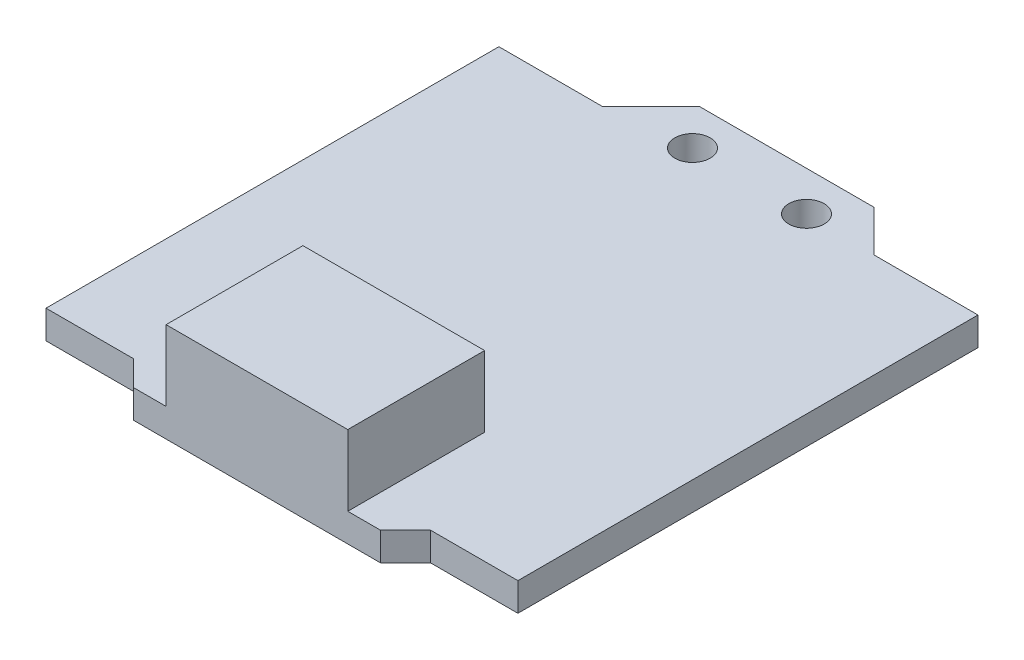
ISO-10303-21;
HEADER;
FILE_DESCRIPTION(('STEP AP214'),'2;1');
FILE_NAME('part.step','',(''),(''),'','','');
FILE_SCHEMA(('AUTOMOTIVE_DESIGN { 1 0 10303 214 1 1 1 1 }'));
ENDSEC;
DATA;
#1=APPLICATION_CONTEXT('core data for automotive mechanical design processes');
#2=APPLICATION_PROTOCOL_DEFINITION('international standard','automotive_design',2000,#1);
#3=PRODUCT_CONTEXT('',#1,'mechanical');
#4=PRODUCT('Part','Part','',(#3));
#5=PRODUCT_RELATED_PRODUCT_CATEGORY('part','',(#4));
#6=PRODUCT_DEFINITION_FORMATION('','',#4);
#7=PRODUCT_DEFINITION_CONTEXT('part definition',#1,'design');
#8=PRODUCT_DEFINITION('design','',#6,#7);
#9=PRODUCT_DEFINITION_SHAPE('','',#8);
#10=(LENGTH_UNIT() NAMED_UNIT(*) SI_UNIT(.MILLI.,.METRE.));
#11=(NAMED_UNIT(*) PLANE_ANGLE_UNIT() SI_UNIT($,.RADIAN.));
#12=(NAMED_UNIT(*) SI_UNIT($,.STERADIAN.) SOLID_ANGLE_UNIT());
#13=UNCERTAINTY_MEASURE_WITH_UNIT(LENGTH_MEASURE(1.E-05),#10,'distance_accuracy_value','');
#14=(GEOMETRIC_REPRESENTATION_CONTEXT(3) GLOBAL_UNCERTAINTY_ASSIGNED_CONTEXT((#13)) GLOBAL_UNIT_ASSIGNED_CONTEXT((#10,
#11,#12)) REPRESENTATION_CONTEXT('',''));
#15=CARTESIAN_POINT('',(0.,0.,0.));
#16=DIRECTION('',(0.,0.,1.));
#17=DIRECTION('',(1.,0.,0.));
#18=AXIS2_PLACEMENT_3D('',#15,#16,#17);
#19=CARTESIAN_POINT('',(0.,1.2,0.));
#20=DIRECTION('',(0.,-1.,0.));
#21=DIRECTION('',(0.,0.,-1.));
#22=AXIS2_PLACEMENT_3D('',#19,#20,#21);
#23=PLANE('',#22);
#24=CARTESIAN_POINT('',(-5.20965393586736,1.2,-12.920685244247));
#25=DIRECTION('',(0.,1.,0.));
#26=DIRECTION('',(0.,0.,1.));
#27=AXIS2_PLACEMENT_3D('',#24,#25,#26);
#28=CIRCLE('',#27,0.75);
#29=CARTESIAN_POINT('',(-5.20965393586736,1.2,-12.170685244247));
#30=VERTEX_POINT('',#29);
#31=EDGE_CURVE('E306',#30,#30,#28,.T.);
#32=ORIENTED_EDGE('',*,*,#31,.F.);
#33=EDGE_LOOP('',(#32));
#34=FACE_BOUND('',#33,.T.);
#35=CARTESIAN_POINT('',(-0.377462837037792,1.2,-12.920685244247));
#36=DIRECTION('',(0.,1.,0.));
#37=DIRECTION('',(0.,0.,1.));
#38=AXIS2_PLACEMENT_3D('',#35,#36,#37);
#39=CIRCLE('',#38,0.750000000000001);
#40=CARTESIAN_POINT('',(-0.377462837037792,1.2,-12.170685244247));
#41=VERTEX_POINT('',#40);
#42=EDGE_CURVE('E313',#41,#41,#39,.T.);
#43=ORIENTED_EDGE('',*,*,#42,.F.);
#44=EDGE_LOOP('',(#43));
#45=FACE_BOUND('',#44,.T.);
#46=DIRECTION('',(0.,0.,1.));
#47=VECTOR('',#46,1.);
#48=CARTESIAN_POINT('',(-6.88130841121496,1.2,1.91720222785461));
#49=LINE('',#48,#47);
#50=CARTESIAN_POINT('',(-6.88130841121496,1.2,1.91720222785461));
#51=VERTEX_POINT('',#50);
#52=CARTESIAN_POINT('',(-6.88130841121496,1.2,7.71720222785461));
#53=VERTEX_POINT('',#52);
#54=EDGE_CURVE('E57',#51,#53,#49,.T.);
#55=ORIENTED_EDGE('',*,*,#54,.F.);
#56=DIRECTION('',(-1.,0.,0.));
#57=VECTOR('',#56,1.);
#58=CARTESIAN_POINT('',(-6.88130841121496,1.2,1.91720222785461));
#59=LINE('',#58,#57);
#60=CARTESIAN_POINT('',(0.818691588785038,1.2,1.91720222785461));
#61=VERTEX_POINT('',#60);
#62=EDGE_CURVE('E176',#61,#51,#59,.T.);
#63=ORIENTED_EDGE('',*,*,#62,.F.);
#64=DIRECTION('',(0.,0.,-1.));
#65=VECTOR('',#64,1.);
#66=CARTESIAN_POINT('',(0.818691588785038,1.2,1.91720222785461));
#67=LINE('',#66,#65);
#68=CARTESIAN_POINT('',(0.818691588785038,1.2,7.71720222785461));
#69=VERTEX_POINT('',#68);
#70=EDGE_CURVE('E63',#69,#61,#67,.T.);
#71=ORIENTED_EDGE('',*,*,#70,.F.);
#72=DIRECTION('',(1.,0.,0.));
#73=VECTOR('',#72,1.);
#74=CARTESIAN_POINT('',(2.20803141700519,1.2,7.71720222785461));
#75=LINE('',#74,#73);
#76=CARTESIAN_POINT('',(2.20803141700519,1.2,7.71720222785461));
#77=VERTEX_POINT('',#76);
#78=EDGE_CURVE('E199',#69,#77,#75,.T.);
#79=ORIENTED_EDGE('',*,*,#78,.T.);
#80=DIRECTION('',(0.707106781186548,0.,-0.707106781186547));
#81=VECTOR('',#80,1.);
#82=CARTESIAN_POINT('',(3.26869158878504,1.2,6.65654205607476));
#83=LINE('',#82,#81);
#84=CARTESIAN_POINT('',(3.26869158878504,1.2,6.65654205607476));
#85=VERTEX_POINT('',#84);
#86=EDGE_CURVE('E203',#77,#85,#83,.T.);
#87=ORIENTED_EDGE('',*,*,#86,.T.);
#88=DIRECTION('',(1.,0.,0.));
#89=VECTOR('',#88,1.);
#90=CARTESIAN_POINT('',(6.96869158878504,1.2,6.65654205607476));
#91=LINE('',#90,#89);
#92=CARTESIAN_POINT('',(6.96869158878504,1.2,6.65654205607476));
#93=VERTEX_POINT('',#92);
#94=EDGE_CURVE('E206',#85,#93,#91,.T.);
#95=ORIENTED_EDGE('',*,*,#94,.T.);
#96=DIRECTION('',(0.,0.,-1.));
#97=VECTOR('',#96,1.);
#98=CARTESIAN_POINT('',(6.96869158878504,1.2,-12.8434579439252));
#99=LINE('',#98,#97);
#100=CARTESIAN_POINT('',(6.96869158878504,1.2,-12.8434579439252));
#101=VERTEX_POINT('',#100);
#102=EDGE_CURVE('E209',#93,#101,#99,.T.);
#103=ORIENTED_EDGE('',*,*,#102,.T.);
#104=DIRECTION('',(-1.,0.,0.));
#105=VECTOR('',#104,1.);
#106=CARTESIAN_POINT('',(2.56869158878503,1.2,-12.8434579439252));
#107=LINE('',#106,#105);
#108=CARTESIAN_POINT('',(2.56869158878503,1.2,-12.8434579439252));
#109=VERTEX_POINT('',#108);
#110=EDGE_CURVE('E212',#101,#109,#107,.T.);
#111=ORIENTED_EDGE('',*,*,#110,.T.);
#112=DIRECTION('',(-0.707106781186547,0.,-0.707106781186548));
#113=VECTOR('',#112,1.);
#114=CARTESIAN_POINT('',(0.818691588785034,1.2,-14.5934579439252));
#115=LINE('',#114,#113);
#116=CARTESIAN_POINT('',(0.818691588785034,1.2,-14.5934579439252));
#117=VERTEX_POINT('',#116);
#118=EDGE_CURVE('E215',#109,#117,#115,.T.);
#119=ORIENTED_EDGE('',*,*,#118,.T.);
#120=DIRECTION('',(-1.,0.,0.));
#121=VECTOR('',#120,1.);
#122=CARTESIAN_POINT('',(-6.57523364485982,1.2,-14.5934579439252));
#123=LINE('',#122,#121);
#124=CARTESIAN_POINT('',(-6.57523364485982,1.2,-14.5934579439252));
#125=VERTEX_POINT('',#124);
#126=EDGE_CURVE('E218',#117,#125,#123,.T.);
#127=ORIENTED_EDGE('',*,*,#126,.T.);
#128=DIRECTION('',(-0.707106781186548,0.,0.707106781186547));
#129=VECTOR('',#128,1.);
#130=CARTESIAN_POINT('',(-8.63130841121496,1.2,-12.5373831775701));
#131=LINE('',#130,#129);
#132=CARTESIAN_POINT('',(-8.63130841121496,1.2,-12.5373831775701));
#133=VERTEX_POINT('',#132);
#134=EDGE_CURVE('E221',#125,#133,#131,.T.);
#135=ORIENTED_EDGE('',*,*,#134,.T.);
#136=DIRECTION('',(-1.,0.,0.));
#137=VECTOR('',#136,1.);
#138=CARTESIAN_POINT('',(-13.031308411215,1.2,-12.5373831775701));
#139=LINE('',#138,#137);
#140=CARTESIAN_POINT('',(-13.031308411215,1.2,-12.5373831775701));
#141=VERTEX_POINT('',#140);
#142=EDGE_CURVE('E224',#133,#141,#139,.T.);
#143=ORIENTED_EDGE('',*,*,#142,.T.);
#144=DIRECTION('',(0.,0.,1.));
#145=VECTOR('',#144,1.);
#146=CARTESIAN_POINT('',(-13.031308411215,1.2,6.65654205607479));
#147=LINE('',#146,#145);
#148=CARTESIAN_POINT('',(-13.031308411215,1.2,6.65654205607479));
#149=VERTEX_POINT('',#148);
#150=EDGE_CURVE('E227',#141,#149,#147,.T.);
#151=ORIENTED_EDGE('',*,*,#150,.T.);
#152=DIRECTION('',(1.,0.,0.));
#153=VECTOR('',#152,1.);
#154=CARTESIAN_POINT('',(-9.33130841121496,1.2,6.65654205607479));
#155=LINE('',#154,#153);
#156=CARTESIAN_POINT('',(-9.33130841121496,1.2,6.65654205607479));
#157=VERTEX_POINT('',#156);
#158=EDGE_CURVE('E191',#149,#157,#155,.T.);
#159=ORIENTED_EDGE('',*,*,#158,.T.);
#160=DIRECTION('',(0.707106781186547,0.,0.707106781186548));
#161=VECTOR('',#160,1.);
#162=CARTESIAN_POINT('',(-8.27064823943514,1.2,7.71720222785461));
#163=LINE('',#162,#161);
#164=CARTESIAN_POINT('',(-8.27064823943514,1.2,7.71720222785461));
#165=VERTEX_POINT('',#164);
#166=EDGE_CURVE('E195',#157,#165,#163,.T.);
#167=ORIENTED_EDGE('',*,*,#166,.T.);
#168=EDGE_CURVE('E200',#165,#53,#75,.T.);
#169=ORIENTED_EDGE('',*,*,#168,.T.);
#170=EDGE_LOOP('',(#55,#63,#71,#79,#87,#95,#103,#111,#119,#127,#135,#143,#151,#159,#167,#169));
#171=FACE_BOUND('',#170,.T.);
#172=ADVANCED_FACE('F39',(#34,#45,#171),#23,.F.);
#173=CARTESIAN_POINT('',(-9.33130841121496,1.2,6.65654205607479));
#174=DIRECTION('',(0.,0.,-1.));
#175=DIRECTION('',(-1.,0.,0.));
#176=AXIS2_PLACEMENT_3D('',#173,#174,#175);
#177=PLANE('',#176);
#178=DIRECTION('',(1.,0.,0.));
#179=VECTOR('',#178,1.);
#180=CARTESIAN_POINT('',(-9.33130841121496,0.,6.65654205607479));
#181=LINE('',#180,#179);
#182=CARTESIAN_POINT('',(-13.031308411215,0.,6.65654205607479));
#183=VERTEX_POINT('',#182);
#184=CARTESIAN_POINT('',(-9.33130841121496,0.,6.65654205607479));
#185=VERTEX_POINT('',#184);
#186=EDGE_CURVE('E180',#183,#185,#181,.T.);
#187=ORIENTED_EDGE('',*,*,#186,.T.);
#188=DIRECTION('',(0.,-1.,0.));
#189=VECTOR('',#188,1.);
#190=CARTESIAN_POINT('',(-9.33130841121496,1.2,6.65654205607479));
#191=LINE('',#190,#189);
#192=EDGE_CURVE('E11',#157,#185,#191,.T.);
#193=ORIENTED_EDGE('',*,*,#192,.F.);
#194=ORIENTED_EDGE('',*,*,#158,.F.);
#195=DIRECTION('',(0.,-1.,0.));
#196=VECTOR('',#195,1.);
#197=CARTESIAN_POINT('',(-13.031308411215,1.2,6.65654205607479));
#198=LINE('',#197,#196);
#199=EDGE_CURVE('E229',#149,#183,#198,.T.);
#200=ORIENTED_EDGE('',*,*,#199,.T.);
#201=EDGE_LOOP('',(#187,#193,#194,#200));
#202=FACE_BOUND('',#201,.T.);
#203=ADVANCED_FACE('F41',(#202),#177,.F.);
#204=CARTESIAN_POINT('',(-8.27064823943514,1.2,7.71720222785461));
#205=DIRECTION('',(0.707106781186548,0.,-0.707106781186547));
#206=DIRECTION('',(-0.707106781186547,0.,-0.707106781186548));
#207=AXIS2_PLACEMENT_3D('',#204,#205,#206);
#208=PLANE('',#207);
#209=DIRECTION('',(0.707106781186547,0.,0.707106781186548));
#210=VECTOR('',#209,1.);
#211=CARTESIAN_POINT('',(-8.27064823943514,0.,7.71720222785461));
#212=LINE('',#211,#210);
#213=CARTESIAN_POINT('',(-8.27064823943514,0.,7.71720222785461));
#214=VERTEX_POINT('',#213);
#215=EDGE_CURVE('E185',#185,#214,#212,.T.);
#216=ORIENTED_EDGE('',*,*,#215,.T.);
#217=DIRECTION('',(0.,-1.,0.));
#218=VECTOR('',#217,1.);
#219=CARTESIAN_POINT('',(-8.27064823943514,1.2,7.71720222785461));
#220=LINE('',#219,#218);
#221=EDGE_CURVE('E49',#165,#214,#220,.T.);
#222=ORIENTED_EDGE('',*,*,#221,.F.);
#223=ORIENTED_EDGE('',*,*,#166,.F.);
#224=ORIENTED_EDGE('',*,*,#192,.T.);
#225=EDGE_LOOP('',(#216,#222,#223,#224));
#226=FACE_BOUND('',#225,.T.);
#227=ADVANCED_FACE('F355',(#226),#208,.F.);
#228=CARTESIAN_POINT('',(2.20803141700519,1.2,7.71720222785461));
#229=DIRECTION('',(0.,0.,-1.));
#230=DIRECTION('',(-1.,0.,0.));
#231=AXIS2_PLACEMENT_3D('',#228,#229,#230);
#232=PLANE('',#231);
#233=DIRECTION('',(1.,0.,0.));
#234=VECTOR('',#233,1.);
#235=CARTESIAN_POINT('',(2.20803141700519,0.,7.71720222785461));
#236=LINE('',#235,#234);
#237=CARTESIAN_POINT('',(2.20803141700519,0.,7.71720222785461));
#238=VERTEX_POINT('',#237);
#239=EDGE_CURVE('E233',#214,#238,#236,.T.);
#240=ORIENTED_EDGE('',*,*,#239,.T.);
#241=DIRECTION('',(0.,-1.,0.));
#242=VECTOR('',#241,1.);
#243=CARTESIAN_POINT('',(2.20803141700519,1.2,7.71720222785461));
#244=LINE('',#243,#242);
#245=EDGE_CURVE('E297',#77,#238,#244,.T.);
#246=ORIENTED_EDGE('',*,*,#245,.F.);
#247=ORIENTED_EDGE('',*,*,#78,.F.);
#248=DIRECTION('',(0.,-1.,0.));
#249=VECTOR('',#248,1.);
#250=CARTESIAN_POINT('',(0.818691588785039,4.2,7.71720222785461));
#251=LINE('',#250,#249);
#252=CARTESIAN_POINT('',(0.818691588785039,4.2,7.71720222785461));
#253=VERTEX_POINT('',#252);
#254=EDGE_CURVE('E161',#253,#69,#251,.T.);
#255=ORIENTED_EDGE('',*,*,#254,.F.);
#256=DIRECTION('',(1.,0.,0.));
#257=VECTOR('',#256,1.);
#258=CARTESIAN_POINT('',(-6.88130841121496,4.2,7.71720222785461));
#259=LINE('',#258,#257);
#260=CARTESIAN_POINT('',(-6.88130841121496,4.2,7.71720222785461));
#261=VERTEX_POINT('',#260);
#262=EDGE_CURVE('E154',#261,#253,#259,.T.);
#263=ORIENTED_EDGE('',*,*,#262,.F.);
#264=DIRECTION('',(0.,-1.,0.));
#265=VECTOR('',#264,1.);
#266=CARTESIAN_POINT('',(-6.88130841121496,4.2,7.71720222785461));
#267=LINE('',#266,#265);
#268=EDGE_CURVE('E159',#261,#53,#267,.T.);
#269=ORIENTED_EDGE('',*,*,#268,.T.);
#270=ORIENTED_EDGE('',*,*,#168,.F.);
#271=ORIENTED_EDGE('',*,*,#221,.T.);
#272=EDGE_LOOP('',(#240,#246,#247,#255,#263,#269,#270,#271));
#273=FACE_BOUND('',#272,.T.);
#274=ADVANCED_FACE('F156',(#273),#232,.F.);
#275=CARTESIAN_POINT('',(3.26869158878504,1.2,6.65654205607476));
#276=DIRECTION('',(-0.707106781186547,0.,-0.707106781186548));
#277=DIRECTION('',(-0.707106781186548,0.,0.707106781186547));
#278=AXIS2_PLACEMENT_3D('',#275,#276,#277);
#279=PLANE('',#278);
#280=DIRECTION('',(0.707106781186548,0.,-0.707106781186547));
#281=VECTOR('',#280,1.);
#282=CARTESIAN_POINT('',(3.26869158878504,0.,6.65654205607476));
#283=LINE('',#282,#281);
#284=CARTESIAN_POINT('',(3.26869158878504,0.,6.65654205607476));
#285=VERTEX_POINT('',#284);
#286=EDGE_CURVE('E236',#238,#285,#283,.T.);
#287=ORIENTED_EDGE('',*,*,#286,.T.);
#288=DIRECTION('',(0.,-1.,0.));
#289=VECTOR('',#288,1.);
#290=CARTESIAN_POINT('',(3.26869158878504,1.2,6.65654205607476));
#291=LINE('',#290,#289);
#292=EDGE_CURVE('E293',#85,#285,#291,.T.);
#293=ORIENTED_EDGE('',*,*,#292,.F.);
#294=ORIENTED_EDGE('',*,*,#86,.F.);
#295=ORIENTED_EDGE('',*,*,#245,.T.);
#296=EDGE_LOOP('',(#287,#293,#294,#295));
#297=FACE_BOUND('',#296,.T.);
#298=ADVANCED_FACE('F393',(#297),#279,.F.);
#299=CARTESIAN_POINT('',(6.96869158878504,1.2,6.65654205607476));
#300=DIRECTION('',(0.,0.,-1.));
#301=DIRECTION('',(-1.,0.,0.));
#302=AXIS2_PLACEMENT_3D('',#299,#300,#301);
#303=PLANE('',#302);
#304=DIRECTION('',(1.,0.,0.));
#305=VECTOR('',#304,1.);
#306=CARTESIAN_POINT('',(6.96869158878504,0.,6.65654205607476));
#307=LINE('',#306,#305);
#308=CARTESIAN_POINT('',(6.96869158878504,0.,6.65654205607476));
#309=VERTEX_POINT('',#308);
#310=EDGE_CURVE('E239',#285,#309,#307,.T.);
#311=ORIENTED_EDGE('',*,*,#310,.T.);
#312=DIRECTION('',(0.,-1.,0.));
#313=VECTOR('',#312,1.);
#314=CARTESIAN_POINT('',(6.96869158878504,1.2,6.65654205607476));
#315=LINE('',#314,#313);
#316=EDGE_CURVE('E289',#93,#309,#315,.T.);
#317=ORIENTED_EDGE('',*,*,#316,.F.);
#318=ORIENTED_EDGE('',*,*,#94,.F.);
#319=ORIENTED_EDGE('',*,*,#292,.T.);
#320=EDGE_LOOP('',(#311,#317,#318,#319));
#321=FACE_BOUND('',#320,.T.);
#322=ADVANCED_FACE('F389',(#321),#303,.F.);
#323=CARTESIAN_POINT('',(6.96869158878504,1.2,-12.8434579439252));
#324=DIRECTION('',(-1.,0.,0.));
#325=DIRECTION('',(0.,0.,1.));
#326=AXIS2_PLACEMENT_3D('',#323,#324,#325);
#327=PLANE('',#326);
#328=DIRECTION('',(0.,0.,-1.));
#329=VECTOR('',#328,1.);
#330=CARTESIAN_POINT('',(6.96869158878504,0.,-12.8434579439252));
#331=LINE('',#330,#329);
#332=CARTESIAN_POINT('',(6.96869158878504,0.,-12.8434579439252));
#333=VERTEX_POINT('',#332);
#334=EDGE_CURVE('E242',#309,#333,#331,.T.);
#335=ORIENTED_EDGE('',*,*,#334,.T.);
#336=DIRECTION('',(0.,-1.,0.));
#337=VECTOR('',#336,1.);
#338=CARTESIAN_POINT('',(6.96869158878504,1.2,-12.8434579439252));
#339=LINE('',#338,#337);
#340=EDGE_CURVE('E285',#101,#333,#339,.T.);
#341=ORIENTED_EDGE('',*,*,#340,.F.);
#342=ORIENTED_EDGE('',*,*,#102,.F.);
#343=ORIENTED_EDGE('',*,*,#316,.T.);
#344=EDGE_LOOP('',(#335,#341,#342,#343));
#345=FACE_BOUND('',#344,.T.);
#346=ADVANCED_FACE('F385',(#345),#327,.F.);
#347=CARTESIAN_POINT('',(2.56869158878503,1.2,-12.8434579439252));
#348=DIRECTION('',(0.,0.,1.));
#349=DIRECTION('',(1.,0.,0.));
#350=AXIS2_PLACEMENT_3D('',#347,#348,#349);
#351=PLANE('',#350);
#352=DIRECTION('',(-1.,0.,0.));
#353=VECTOR('',#352,1.);
#354=CARTESIAN_POINT('',(2.56869158878503,0.,-12.8434579439252));
#355=LINE('',#354,#353);
#356=CARTESIAN_POINT('',(2.56869158878503,0.,-12.8434579439252));
#357=VERTEX_POINT('',#356);
#358=EDGE_CURVE('E245',#333,#357,#355,.T.);
#359=ORIENTED_EDGE('',*,*,#358,.T.);
#360=DIRECTION('',(0.,-1.,0.));
#361=VECTOR('',#360,1.);
#362=CARTESIAN_POINT('',(2.56869158878503,1.2,-12.8434579439252));
#363=LINE('',#362,#361);
#364=EDGE_CURVE('E281',#109,#357,#363,.T.);
#365=ORIENTED_EDGE('',*,*,#364,.F.);
#366=ORIENTED_EDGE('',*,*,#110,.F.);
#367=ORIENTED_EDGE('',*,*,#340,.T.);
#368=EDGE_LOOP('',(#359,#365,#366,#367));
#369=FACE_BOUND('',#368,.T.);
#370=ADVANCED_FACE('F381',(#369),#351,.F.);
#371=CARTESIAN_POINT('',(0.818691588785034,1.2,-14.5934579439252));
#372=DIRECTION('',(-0.707106781186548,0.,0.707106781186547));
#373=DIRECTION('',(0.707106781186547,0.,0.707106781186548));
#374=AXIS2_PLACEMENT_3D('',#371,#372,#373);
#375=PLANE('',#374);
#376=DIRECTION('',(-0.707106781186547,0.,-0.707106781186548));
#377=VECTOR('',#376,1.);
#378=CARTESIAN_POINT('',(0.818691588785034,0.,-14.5934579439252));
#379=LINE('',#378,#377);
#380=CARTESIAN_POINT('',(0.818691588785034,0.,-14.5934579439252));
#381=VERTEX_POINT('',#380);
#382=EDGE_CURVE('E248',#357,#381,#379,.T.);
#383=ORIENTED_EDGE('',*,*,#382,.T.);
#384=DIRECTION('',(0.,-1.,0.));
#385=VECTOR('',#384,1.);
#386=CARTESIAN_POINT('',(0.818691588785034,1.2,-14.5934579439252));
#387=LINE('',#386,#385);
#388=EDGE_CURVE('E277',#117,#381,#387,.T.);
#389=ORIENTED_EDGE('',*,*,#388,.F.);
#390=ORIENTED_EDGE('',*,*,#118,.F.);
#391=ORIENTED_EDGE('',*,*,#364,.T.);
#392=EDGE_LOOP('',(#383,#389,#390,#391));
#393=FACE_BOUND('',#392,.T.);
#394=ADVANCED_FACE('F377',(#393),#375,.F.);
#395=CARTESIAN_POINT('',(-6.57523364485982,1.2,-14.5934579439252));
#396=DIRECTION('',(0.,0.,1.));
#397=DIRECTION('',(1.,0.,0.));
#398=AXIS2_PLACEMENT_3D('',#395,#396,#397);
#399=PLANE('',#398);
#400=DIRECTION('',(-1.,0.,0.));
#401=VECTOR('',#400,1.);
#402=CARTESIAN_POINT('',(-6.57523364485982,0.,-14.5934579439252));
#403=LINE('',#402,#401);
#404=CARTESIAN_POINT('',(-6.57523364485982,0.,-14.5934579439252));
#405=VERTEX_POINT('',#404);
#406=EDGE_CURVE('E251',#381,#405,#403,.T.);
#407=ORIENTED_EDGE('',*,*,#406,.T.);
#408=DIRECTION('',(0.,-1.,0.));
#409=VECTOR('',#408,1.);
#410=CARTESIAN_POINT('',(-6.57523364485982,1.2,-14.5934579439252));
#411=LINE('',#410,#409);
#412=EDGE_CURVE('E273',#125,#405,#411,.T.);
#413=ORIENTED_EDGE('',*,*,#412,.F.);
#414=ORIENTED_EDGE('',*,*,#126,.F.);
#415=ORIENTED_EDGE('',*,*,#388,.T.);
#416=EDGE_LOOP('',(#407,#413,#414,#415));
#417=FACE_BOUND('',#416,.T.);
#418=ADVANCED_FACE('F373',(#417),#399,.F.);
#419=CARTESIAN_POINT('',(-8.63130841121496,1.2,-12.5373831775701));
#420=DIRECTION('',(0.707106781186547,0.,0.707106781186548));
#421=DIRECTION('',(0.707106781186548,0.,-0.707106781186547));
#422=AXIS2_PLACEMENT_3D('',#419,#420,#421);
#423=PLANE('',#422);
#424=DIRECTION('',(-0.707106781186548,0.,0.707106781186547));
#425=VECTOR('',#424,1.);
#426=CARTESIAN_POINT('',(-8.63130841121496,0.,-12.5373831775701));
#427=LINE('',#426,#425);
#428=CARTESIAN_POINT('',(-8.63130841121496,0.,-12.5373831775701));
#429=VERTEX_POINT('',#428);
#430=EDGE_CURVE('E254',#405,#429,#427,.T.);
#431=ORIENTED_EDGE('',*,*,#430,.T.);
#432=DIRECTION('',(0.,-1.,0.));
#433=VECTOR('',#432,1.);
#434=CARTESIAN_POINT('',(-8.63130841121496,1.2,-12.5373831775701));
#435=LINE('',#434,#433);
#436=EDGE_CURVE('E269',#133,#429,#435,.T.);
#437=ORIENTED_EDGE('',*,*,#436,.F.);
#438=ORIENTED_EDGE('',*,*,#134,.F.);
#439=ORIENTED_EDGE('',*,*,#412,.T.);
#440=EDGE_LOOP('',(#431,#437,#438,#439));
#441=FACE_BOUND('',#440,.T.);
#442=ADVANCED_FACE('F369',(#441),#423,.F.);
#443=CARTESIAN_POINT('',(-13.031308411215,1.2,-12.5373831775701));
#444=DIRECTION('',(0.,0.,1.));
#445=DIRECTION('',(1.,0.,0.));
#446=AXIS2_PLACEMENT_3D('',#443,#444,#445);
#447=PLANE('',#446);
#448=DIRECTION('',(-1.,0.,0.));
#449=VECTOR('',#448,1.);
#450=CARTESIAN_POINT('',(-13.031308411215,0.,-12.5373831775701));
#451=LINE('',#450,#449);
#452=CARTESIAN_POINT('',(-13.031308411215,0.,-12.5373831775701));
#453=VERTEX_POINT('',#452);
#454=EDGE_CURVE('E257',#429,#453,#451,.T.);
#455=ORIENTED_EDGE('',*,*,#454,.T.);
#456=DIRECTION('',(0.,-1.,0.));
#457=VECTOR('',#456,1.);
#458=CARTESIAN_POINT('',(-13.031308411215,1.2,-12.5373831775701));
#459=LINE('',#458,#457);
#460=EDGE_CURVE('E265',#141,#453,#459,.T.);
#461=ORIENTED_EDGE('',*,*,#460,.F.);
#462=ORIENTED_EDGE('',*,*,#142,.F.);
#463=ORIENTED_EDGE('',*,*,#436,.T.);
#464=EDGE_LOOP('',(#455,#461,#462,#463));
#465=FACE_BOUND('',#464,.T.);
#466=ADVANCED_FACE('F365',(#465),#447,.F.);
#467=CARTESIAN_POINT('',(-13.031308411215,1.2,6.65654205607479));
#468=DIRECTION('',(1.,0.,0.));
#469=DIRECTION('',(0.,0.,-1.));
#470=AXIS2_PLACEMENT_3D('',#467,#468,#469);
#471=PLANE('',#470);
#472=DIRECTION('',(0.,0.,1.));
#473=VECTOR('',#472,1.);
#474=CARTESIAN_POINT('',(-13.031308411215,0.,6.65654205607479));
#475=LINE('',#474,#473);
#476=EDGE_CURVE('E196',#453,#183,#475,.T.);
#477=ORIENTED_EDGE('',*,*,#476,.T.);
#478=ORIENTED_EDGE('',*,*,#199,.F.);
#479=ORIENTED_EDGE('',*,*,#150,.F.);
#480=ORIENTED_EDGE('',*,*,#460,.T.);
#481=EDGE_LOOP('',(#477,#478,#479,#480));
#482=FACE_BOUND('',#481,.T.);
#483=ADVANCED_FACE('F361',(#482),#471,.F.);
#484=CARTESIAN_POINT('',(0.,0.,0.));
#485=DIRECTION('',(0.,-1.,0.));
#486=DIRECTION('',(0.,0.,-1.));
#487=AXIS2_PLACEMENT_3D('',#484,#485,#486);
#488=PLANE('',#487);
#489=CARTESIAN_POINT('',(-5.20965393586736,0.,-12.920685244247));
#490=DIRECTION('',(0.,-1.,0.));
#491=DIRECTION('',(0.,0.,-1.));
#492=AXIS2_PLACEMENT_3D('',#489,#490,#491);
#493=CIRCLE('',#492,0.75);
#494=CARTESIAN_POINT('',(-5.20965393586736,0.,-13.670685244247));
#495=VERTEX_POINT('',#494);
#496=EDGE_CURVE('E43',#495,#495,#493,.T.);
#497=ORIENTED_EDGE('',*,*,#496,.F.);
#498=EDGE_LOOP('',(#497));
#499=FACE_BOUND('',#498,.T.);
#500=CARTESIAN_POINT('',(-0.377462837037792,0.,-12.920685244247));
#501=DIRECTION('',(0.,-1.,0.));
#502=DIRECTION('',(0.,0.,-1.));
#503=AXIS2_PLACEMENT_3D('',#500,#501,#502);
#504=CIRCLE('',#503,0.750000000000001);
#505=CARTESIAN_POINT('',(-0.377462837037792,0.,-13.670685244247));
#506=VERTEX_POINT('',#505);
#507=EDGE_CURVE('E303',#506,#506,#504,.T.);
#508=ORIENTED_EDGE('',*,*,#507,.F.);
#509=EDGE_LOOP('',(#508));
#510=FACE_BOUND('',#509,.T.);
#511=ORIENTED_EDGE('',*,*,#186,.F.);
#512=ORIENTED_EDGE('',*,*,#476,.F.);
#513=ORIENTED_EDGE('',*,*,#454,.F.);
#514=ORIENTED_EDGE('',*,*,#430,.F.);
#515=ORIENTED_EDGE('',*,*,#406,.F.);
#516=ORIENTED_EDGE('',*,*,#382,.F.);
#517=ORIENTED_EDGE('',*,*,#358,.F.);
#518=ORIENTED_EDGE('',*,*,#334,.F.);
#519=ORIENTED_EDGE('',*,*,#310,.F.);
#520=ORIENTED_EDGE('',*,*,#286,.F.);
#521=ORIENTED_EDGE('',*,*,#239,.F.);
#522=ORIENTED_EDGE('',*,*,#215,.F.);
#523=EDGE_LOOP('',(#511,#512,#513,#514,#515,#516,#517,#518,#519,#520,#521,#522));
#524=FACE_BOUND('',#523,.T.);
#525=ADVANCED_FACE('F347',(#499,#510,#524),#488,.T.);
#526=CARTESIAN_POINT('',(-6.88130841121496,4.2,1.91720222785461));
#527=DIRECTION('',(1.,0.,0.));
#528=DIRECTION('',(0.,0.,-1.));
#529=AXIS2_PLACEMENT_3D('',#526,#527,#528);
#530=PLANE('',#529);
#531=ORIENTED_EDGE('',*,*,#54,.T.);
#532=ORIENTED_EDGE('',*,*,#268,.F.);
#533=DIRECTION('',(0.,0.,1.));
#534=VECTOR('',#533,1.);
#535=CARTESIAN_POINT('',(-6.88130841121496,4.2,1.91720222785461));
#536=LINE('',#535,#534);
#537=CARTESIAN_POINT('',(-6.88130841121496,4.2,1.91720222785461));
#538=VERTEX_POINT('',#537);
#539=EDGE_CURVE('E166',#538,#261,#536,.T.);
#540=ORIENTED_EDGE('',*,*,#539,.F.);
#541=DIRECTION('',(0.,-1.,0.));
#542=VECTOR('',#541,1.);
#543=CARTESIAN_POINT('',(-6.88130841121496,4.2,1.91720222785461));
#544=LINE('',#543,#542);
#545=EDGE_CURVE('E325',#538,#51,#544,.T.);
#546=ORIENTED_EDGE('',*,*,#545,.T.);
#547=EDGE_LOOP('',(#531,#532,#540,#546));
#548=FACE_BOUND('',#547,.T.);
#549=ADVANCED_FACE('F178',(#548),#530,.F.);
#550=CARTESIAN_POINT('',(0.818691588785038,4.2,1.91720222785461));
#551=DIRECTION('',(-1.,0.,0.));
#552=DIRECTION('',(0.,0.,1.));
#553=AXIS2_PLACEMENT_3D('',#550,#551,#552);
#554=PLANE('',#553);
#555=ORIENTED_EDGE('',*,*,#70,.T.);
#556=DIRECTION('',(0.,-1.,0.));
#557=VECTOR('',#556,1.);
#558=CARTESIAN_POINT('',(0.818691588785038,4.2,1.91720222785461));
#559=LINE('',#558,#557);
#560=CARTESIAN_POINT('',(0.818691588785038,4.2,1.91720222785461));
#561=VERTEX_POINT('',#560);
#562=EDGE_CURVE('E187',#561,#61,#559,.T.);
#563=ORIENTED_EDGE('',*,*,#562,.F.);
#564=DIRECTION('',(0.,0.,-1.));
#565=VECTOR('',#564,1.);
#566=CARTESIAN_POINT('',(0.818691588785038,4.2,1.91720222785461));
#567=LINE('',#566,#565);
#568=EDGE_CURVE('E165',#253,#561,#567,.T.);
#569=ORIENTED_EDGE('',*,*,#568,.F.);
#570=ORIENTED_EDGE('',*,*,#254,.T.);
#571=EDGE_LOOP('',(#555,#563,#569,#570));
#572=FACE_BOUND('',#571,.T.);
#573=ADVANCED_FACE('F339',(#572),#554,.F.);
#574=CARTESIAN_POINT('',(-6.88130841121496,4.2,1.91720222785461));
#575=DIRECTION('',(0.,0.,1.));
#576=DIRECTION('',(1.,0.,0.));
#577=AXIS2_PLACEMENT_3D('',#574,#575,#576);
#578=PLANE('',#577);
#579=ORIENTED_EDGE('',*,*,#62,.T.);
#580=ORIENTED_EDGE('',*,*,#545,.F.);
#581=DIRECTION('',(-1.,0.,0.));
#582=VECTOR('',#581,1.);
#583=CARTESIAN_POINT('',(-6.88130841121496,4.2,1.91720222785461));
#584=LINE('',#583,#582);
#585=EDGE_CURVE('E171',#561,#538,#584,.T.);
#586=ORIENTED_EDGE('',*,*,#585,.F.);
#587=ORIENTED_EDGE('',*,*,#562,.T.);
#588=EDGE_LOOP('',(#579,#580,#586,#587));
#589=FACE_BOUND('',#588,.T.);
#590=ADVANCED_FACE('F337',(#589),#578,.F.);
#591=CARTESIAN_POINT('',(0.,4.2,0.));
#592=DIRECTION('',(0.,1.,0.));
#593=DIRECTION('',(0.,0.,1.));
#594=AXIS2_PLACEMENT_3D('',#591,#592,#593);
#595=PLANE('',#594);
#596=ORIENTED_EDGE('',*,*,#539,.T.);
#597=ORIENTED_EDGE('',*,*,#262,.T.);
#598=ORIENTED_EDGE('',*,*,#568,.T.);
#599=ORIENTED_EDGE('',*,*,#585,.T.);
#600=EDGE_LOOP('',(#596,#597,#598,#599));
#601=FACE_BOUND('',#600,.T.);
#602=ADVANCED_FACE('F169',(#601),#595,.T.);
#603=CARTESIAN_POINT('',(-0.377462837037792,-1.8,-12.920685244247));
#604=DIRECTION('',(0.,1.,0.));
#605=DIRECTION('',(0.,0.,1.));
#606=AXIS2_PLACEMENT_3D('',#603,#604,#605);
#607=CYLINDRICAL_SURFACE('',#606,0.750000000000001);
#608=ORIENTED_EDGE('',*,*,#507,.T.);
#609=EDGE_LOOP('',(#608));
#610=FACE_BOUND('',#609,.T.);
#611=ORIENTED_EDGE('',*,*,#42,.T.);
#612=EDGE_LOOP('',(#611));
#613=FACE_BOUND('',#612,.T.);
#614=ADVANCED_FACE('F507',(#610,#613),#607,.F.);
#615=CARTESIAN_POINT('',(-5.20965393586736,-1.8,-12.920685244247));
#616=DIRECTION('',(0.,1.,0.));
#617=DIRECTION('',(0.,0.,1.));
#618=AXIS2_PLACEMENT_3D('',#615,#616,#617);
#619=CYLINDRICAL_SURFACE('',#618,0.75);
#620=ORIENTED_EDGE('',*,*,#496,.T.);
#621=EDGE_LOOP('',(#620));
#622=FACE_BOUND('',#621,.T.);
#623=ORIENTED_EDGE('',*,*,#31,.T.);
#624=EDGE_LOOP('',(#623));
#625=FACE_BOUND('',#624,.T.);
#626=ADVANCED_FACE('F551',(#622,#625),#619,.F.);
#627=CLOSED_SHELL('',(#172,#203,#227,#274,#298,#322,#346,#370,#394,#418,#442,#466,#483,#525,
#549,#573,#590,#602,#614,#626));
#628=MANIFOLD_SOLID_BREP('B2',#627);
#629=ADVANCED_BREP_SHAPE_REPRESENTATION('',(#18,#628),#14);
#630=SHAPE_DEFINITION_REPRESENTATION(#9,#629);
ENDSEC;
END-ISO-10303-21;
